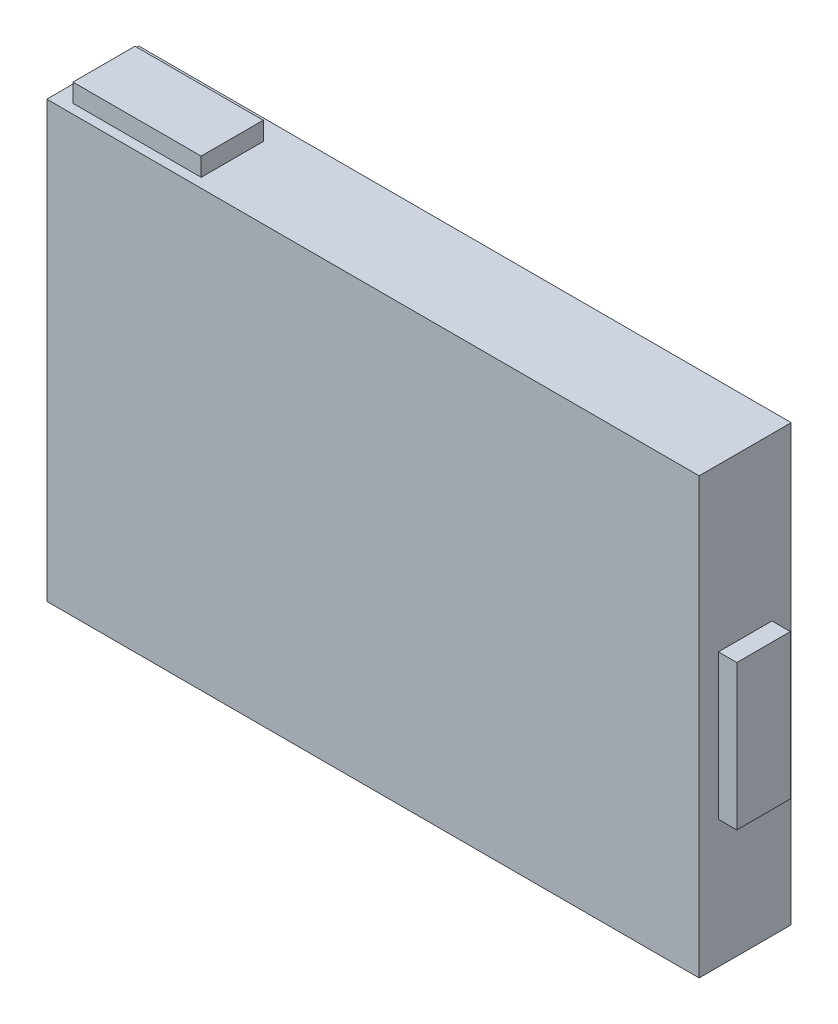
ISO-10303-21;
HEADER;
FILE_DESCRIPTION(('STEP AP214'),'2;1');
FILE_NAME('part.step','',(''),(''),'','','');
FILE_SCHEMA(('AUTOMOTIVE_DESIGN { 1 0 10303 214 1 1 1 1 }'));
ENDSEC;
DATA;
#1=APPLICATION_CONTEXT('core data for automotive mechanical design processes');
#2=APPLICATION_PROTOCOL_DEFINITION('international standard','automotive_design',2000,#1);
#3=PRODUCT_CONTEXT('',#1,'mechanical');
#4=PRODUCT('Part','Part','',(#3));
#5=PRODUCT_RELATED_PRODUCT_CATEGORY('part','',(#4));
#6=PRODUCT_DEFINITION_FORMATION('','',#4);
#7=PRODUCT_DEFINITION_CONTEXT('part definition',#1,'design');
#8=PRODUCT_DEFINITION('design','',#6,#7);
#9=PRODUCT_DEFINITION_SHAPE('','',#8);
#10=(LENGTH_UNIT() NAMED_UNIT(*) SI_UNIT(.MILLI.,.METRE.));
#11=(NAMED_UNIT(*) PLANE_ANGLE_UNIT() SI_UNIT($,.RADIAN.));
#12=(NAMED_UNIT(*) SI_UNIT($,.STERADIAN.) SOLID_ANGLE_UNIT());
#13=UNCERTAINTY_MEASURE_WITH_UNIT(LENGTH_MEASURE(1.E-05),#10,'distance_accuracy_value','');
#14=(GEOMETRIC_REPRESENTATION_CONTEXT(3) GLOBAL_UNCERTAINTY_ASSIGNED_CONTEXT((#13)) GLOBAL_UNIT_ASSIGNED_CONTEXT((#10,
#11,#12)) REPRESENTATION_CONTEXT('',''));
#15=CARTESIAN_POINT('',(0.,0.,0.));
#16=DIRECTION('',(0.,0.,1.));
#17=DIRECTION('',(1.,0.,0.));
#18=AXIS2_PLACEMENT_3D('',#15,#16,#17);
#19=CARTESIAN_POINT('',(95.8711409144546,-20.,20.0911619857132));
#20=DIRECTION('',(0.,0.,-1.));
#21=DIRECTION('',(-1.,0.,0.));
#22=AXIS2_PLACEMENT_3D('',#19,#20,#21);
#23=PLANE('',#22);
#24=DIRECTION('',(0.,-1.,0.));
#25=VECTOR('',#24,1.);
#26=CARTESIAN_POINT('',(90.7911409144546,-20.,20.0911619857132));
#27=LINE('',#26,#25);
#28=CARTESIAN_POINT('',(90.7911409144546,20.,20.0911619857132));
#29=VERTEX_POINT('',#28);
#30=CARTESIAN_POINT('',(90.7911409144546,-20.,20.0911619857132));
#31=VERTEX_POINT('',#30);
#32=EDGE_CURVE('E106',#29,#31,#27,.T.);
#33=ORIENTED_EDGE('',*,*,#32,.T.);
#34=DIRECTION('',(-1.,0.,0.));
#35=VECTOR('',#34,1.);
#36=CARTESIAN_POINT('',(95.8711409144546,-20.,20.0911619857132));
#37=LINE('',#36,#35);
#38=CARTESIAN_POINT('',(95.8711409144546,-20.,20.0911619857132));
#39=VERTEX_POINT('',#38);
#40=EDGE_CURVE('E12',#39,#31,#37,.T.);
#41=ORIENTED_EDGE('',*,*,#40,.F.);
#42=DIRECTION('',(0.,-1.,0.));
#43=VECTOR('',#42,1.);
#44=CARTESIAN_POINT('',(95.8711409144546,-20.,20.0911619857132));
#45=LINE('',#44,#43);
#46=CARTESIAN_POINT('',(95.8711409144546,20.,20.0911619857132));
#47=VERTEX_POINT('',#46);
#48=EDGE_CURVE('E94',#47,#39,#45,.T.);
#49=ORIENTED_EDGE('',*,*,#48,.F.);
#50=DIRECTION('',(-1.,0.,0.));
#51=VECTOR('',#50,1.);
#52=CARTESIAN_POINT('',(95.8711409144546,20.,20.0911619857132));
#53=LINE('',#52,#51);
#54=EDGE_CURVE('E102',#47,#29,#53,.T.);
#55=ORIENTED_EDGE('',*,*,#54,.T.);
#56=EDGE_LOOP('',(#33,#41,#49,#55));
#57=FACE_BOUND('',#56,.T.);
#58=ADVANCED_FACE('F43',(#57),#23,.F.);
#59=CARTESIAN_POINT('',(95.8711409144546,-20.,5.3088380142868));
#60=DIRECTION('',(0.,1.,0.));
#61=DIRECTION('',(0.,0.,1.));
#62=AXIS2_PLACEMENT_3D('',#59,#60,#61);
#63=PLANE('',#62);
#64=DIRECTION('',(0.,0.,-1.));
#65=VECTOR('',#64,1.);
#66=CARTESIAN_POINT('',(90.7911409144546,-20.,5.3088380142868));
#67=LINE('',#66,#65);
#68=CARTESIAN_POINT('',(90.7911409144546,-20.,5.3088380142868));
#69=VERTEX_POINT('',#68);
#70=EDGE_CURVE('E98',#31,#69,#67,.T.);
#71=ORIENTED_EDGE('',*,*,#70,.T.);
#72=DIRECTION('',(-1.,0.,0.));
#73=VECTOR('',#72,1.);
#74=CARTESIAN_POINT('',(95.8711409144546,-20.,5.3088380142868));
#75=LINE('',#74,#73);
#76=CARTESIAN_POINT('',(95.8711409144546,-20.,5.3088380142868));
#77=VERTEX_POINT('',#76);
#78=EDGE_CURVE('E51',#77,#69,#75,.T.);
#79=ORIENTED_EDGE('',*,*,#78,.F.);
#80=DIRECTION('',(0.,0.,-1.));
#81=VECTOR('',#80,1.);
#82=CARTESIAN_POINT('',(95.8711409144546,-20.,5.3088380142868));
#83=LINE('',#82,#81);
#84=EDGE_CURVE('E89',#39,#77,#83,.T.);
#85=ORIENTED_EDGE('',*,*,#84,.F.);
#86=ORIENTED_EDGE('',*,*,#40,.T.);
#87=EDGE_LOOP('',(#71,#79,#85,#86));
#88=FACE_BOUND('',#87,.T.);
#89=ADVANCED_FACE('F97',(#88),#63,.F.);
#90=CARTESIAN_POINT('',(95.8711409144546,-20.,5.3088380142868));
#91=DIRECTION('',(0.,0.,1.));
#92=DIRECTION('',(1.,0.,0.));
#93=AXIS2_PLACEMENT_3D('',#90,#91,#92);
#94=PLANE('',#93);
#95=DIRECTION('',(0.,1.,0.));
#96=VECTOR('',#95,1.);
#97=CARTESIAN_POINT('',(90.7911409144546,-20.,5.3088380142868));
#98=LINE('',#97,#96);
#99=CARTESIAN_POINT('',(90.7911409144546,20.,5.3088380142868));
#100=VERTEX_POINT('',#99);
#101=EDGE_CURVE('E76',#69,#100,#98,.T.);
#102=ORIENTED_EDGE('',*,*,#101,.T.);
#103=DIRECTION('',(-1.,0.,0.));
#104=VECTOR('',#103,1.);
#105=CARTESIAN_POINT('',(95.8711409144546,20.,5.3088380142868));
#106=LINE('',#105,#104);
#107=CARTESIAN_POINT('',(95.8711409144546,20.,5.3088380142868));
#108=VERTEX_POINT('',#107);
#109=EDGE_CURVE('E99',#108,#100,#106,.T.);
#110=ORIENTED_EDGE('',*,*,#109,.F.);
#111=DIRECTION('',(0.,1.,0.));
#112=VECTOR('',#111,1.);
#113=CARTESIAN_POINT('',(95.8711409144546,-20.,5.3088380142868));
#114=LINE('',#113,#112);
#115=EDGE_CURVE('E92',#77,#108,#114,.T.);
#116=ORIENTED_EDGE('',*,*,#115,.F.);
#117=ORIENTED_EDGE('',*,*,#78,.T.);
#118=EDGE_LOOP('',(#102,#110,#116,#117));
#119=FACE_BOUND('',#118,.T.);
#120=ADVANCED_FACE('F100',(#119),#94,.F.);
#121=CARTESIAN_POINT('',(95.8711409144546,20.,5.3088380142868));
#122=DIRECTION('',(0.,-1.,0.));
#123=DIRECTION('',(0.,0.,-1.));
#124=AXIS2_PLACEMENT_3D('',#121,#122,#123);
#125=PLANE('',#124);
#126=DIRECTION('',(0.,0.,1.));
#127=VECTOR('',#126,1.);
#128=CARTESIAN_POINT('',(90.7911409144546,20.,5.3088380142868));
#129=LINE('',#128,#127);
#130=EDGE_CURVE('E82',#100,#29,#129,.T.);
#131=ORIENTED_EDGE('',*,*,#130,.T.);
#132=ORIENTED_EDGE('',*,*,#54,.F.);
#133=DIRECTION('',(0.,0.,1.));
#134=VECTOR('',#133,1.);
#135=CARTESIAN_POINT('',(95.8711409144546,20.,5.3088380142868));
#136=LINE('',#135,#134);
#137=EDGE_CURVE('E59',#108,#47,#136,.T.);
#138=ORIENTED_EDGE('',*,*,#137,.F.);
#139=ORIENTED_EDGE('',*,*,#109,.T.);
#140=EDGE_LOOP('',(#131,#132,#138,#139));
#141=FACE_BOUND('',#140,.T.);
#142=ADVANCED_FACE('F113',(#141),#125,.F.);
#143=CARTESIAN_POINT('',(95.8711409144546,0.,0.));
#144=DIRECTION('',(1.,0.,0.));
#145=DIRECTION('',(0.,0.,-1.));
#146=AXIS2_PLACEMENT_3D('',#143,#144,#145);
#147=PLANE('',#146);
#148=ORIENTED_EDGE('',*,*,#48,.T.);
#149=ORIENTED_EDGE('',*,*,#84,.T.);
#150=ORIENTED_EDGE('',*,*,#115,.T.);
#151=ORIENTED_EDGE('',*,*,#137,.T.);
#152=EDGE_LOOP('',(#148,#149,#150,#151));
#153=FACE_BOUND('',#152,.T.);
#154=ADVANCED_FACE('F90',(#153),#147,.T.);
#155=CARTESIAN_POINT('',(90.7911409144546,0.,0.));
#156=DIRECTION('',(1.,0.,0.));
#157=DIRECTION('',(0.,0.,-1.));
#158=AXIS2_PLACEMENT_3D('',#155,#156,#157);
#159=PLANE('',#158);
#160=ORIENTED_EDGE('',*,*,#32,.F.);
#161=ORIENTED_EDGE('',*,*,#130,.F.);
#162=ORIENTED_EDGE('',*,*,#101,.F.);
#163=ORIENTED_EDGE('',*,*,#70,.F.);
#164=EDGE_LOOP('',(#160,#161,#162,#163));
#165=FACE_BOUND('',#164,.T.);
#166=ADVANCED_FACE('F116',(#165),#159,.F.);
#167=CLOSED_SHELL('',(#58,#89,#120,#142,#154,#166));
#168=MANIFOLD_SOLID_BREP('B2',#167);
#169=CARTESIAN_POINT('',(-84.6027899747349,69.8100094084312,22.786985363933));
#170=DIRECTION('',(1.,0.,0.));
#171=DIRECTION('',(0.,0.,-1.));
#172=AXIS2_PLACEMENT_3D('',#169,#170,#171);
#173=PLANE('',#172);
#174=DIRECTION('',(0.,0.,1.));
#175=VECTOR('',#174,1.);
#176=CARTESIAN_POINT('',(-84.6027899747349,64.7300094084312,22.786985363933));
#177=LINE('',#176,#175);
#178=CARTESIAN_POINT('',(-84.6027899747349,64.7300094084312,5.65292803341598));
#179=VERTEX_POINT('',#178);
#180=CARTESIAN_POINT('',(-84.6027899747349,64.7300094084312,22.786985363933));
#181=VERTEX_POINT('',#180);
#182=EDGE_CURVE('E238',#179,#181,#177,.T.);
#183=ORIENTED_EDGE('',*,*,#182,.T.);
#184=DIRECTION('',(0.,-1.,0.));
#185=VECTOR('',#184,1.);
#186=CARTESIAN_POINT('',(-84.6027899747349,69.8100094084312,22.786985363933));
#187=LINE('',#186,#185);
#188=CARTESIAN_POINT('',(-84.6027899747349,69.8100094084312,22.786985363933));
#189=VERTEX_POINT('',#188);
#190=EDGE_CURVE('E41',#189,#181,#187,.T.);
#191=ORIENTED_EDGE('',*,*,#190,.F.);
#192=DIRECTION('',(0.,0.,1.));
#193=VECTOR('',#192,1.);
#194=CARTESIAN_POINT('',(-84.6027899747349,69.8100094084312,22.786985363933));
#195=LINE('',#194,#193);
#196=CARTESIAN_POINT('',(-84.6027899747349,69.8100094084312,5.65292803341598));
#197=VERTEX_POINT('',#196);
#198=EDGE_CURVE('E226',#197,#189,#195,.T.);
#199=ORIENTED_EDGE('',*,*,#198,.F.);
#200=DIRECTION('',(0.,-1.,0.));
#201=VECTOR('',#200,1.);
#202=CARTESIAN_POINT('',(-84.6027899747349,69.8100094084312,5.65292803341598));
#203=LINE('',#202,#201);
#204=EDGE_CURVE('E234',#197,#179,#203,.T.);
#205=ORIENTED_EDGE('',*,*,#204,.T.);
#206=EDGE_LOOP('',(#183,#191,#199,#205));
#207=FACE_BOUND('',#206,.T.);
#208=ADVANCED_FACE('F175',(#207),#173,.F.);
#209=CARTESIAN_POINT('',(-49.2292522601191,69.8100094084312,22.786985363933));
#210=DIRECTION('',(0.,0.,-1.));
#211=DIRECTION('',(-1.,0.,0.));
#212=AXIS2_PLACEMENT_3D('',#209,#210,#211);
#213=PLANE('',#212);
#214=DIRECTION('',(1.,0.,0.));
#215=VECTOR('',#214,1.);
#216=CARTESIAN_POINT('',(-49.2292522601191,64.7300094084312,22.786985363933));
#217=LINE('',#216,#215);
#218=CARTESIAN_POINT('',(-49.2292522601191,64.7300094084312,22.786985363933));
#219=VERTEX_POINT('',#218);
#220=EDGE_CURVE('E230',#181,#219,#217,.T.);
#221=ORIENTED_EDGE('',*,*,#220,.T.);
#222=DIRECTION('',(0.,-1.,0.));
#223=VECTOR('',#222,1.);
#224=CARTESIAN_POINT('',(-49.2292522601191,69.8100094084312,22.786985363933));
#225=LINE('',#224,#223);
#226=CARTESIAN_POINT('',(-49.2292522601191,69.8100094084312,22.786985363933));
#227=VERTEX_POINT('',#226);
#228=EDGE_CURVE('E183',#227,#219,#225,.T.);
#229=ORIENTED_EDGE('',*,*,#228,.F.);
#230=DIRECTION('',(1.,0.,0.));
#231=VECTOR('',#230,1.);
#232=CARTESIAN_POINT('',(-49.2292522601191,69.8100094084312,22.786985363933));
#233=LINE('',#232,#231);
#234=EDGE_CURVE('E221',#189,#227,#233,.T.);
#235=ORIENTED_EDGE('',*,*,#234,.F.);
#236=ORIENTED_EDGE('',*,*,#190,.T.);
#237=EDGE_LOOP('',(#221,#229,#235,#236));
#238=FACE_BOUND('',#237,.T.);
#239=ADVANCED_FACE('F229',(#238),#213,.F.);
#240=CARTESIAN_POINT('',(-49.2292522601191,69.8100094084312,22.786985363933));
#241=DIRECTION('',(-1.,0.,0.));
#242=DIRECTION('',(0.,0.,1.));
#243=AXIS2_PLACEMENT_3D('',#240,#241,#242);
#244=PLANE('',#243);
#245=DIRECTION('',(0.,0.,-1.));
#246=VECTOR('',#245,1.);
#247=CARTESIAN_POINT('',(-49.2292522601191,64.7300094084312,22.786985363933));
#248=LINE('',#247,#246);
#249=CARTESIAN_POINT('',(-49.2292522601191,64.7300094084312,5.65292803341598));
#250=VERTEX_POINT('',#249);
#251=EDGE_CURVE('E208',#219,#250,#248,.T.);
#252=ORIENTED_EDGE('',*,*,#251,.T.);
#253=DIRECTION('',(0.,-1.,0.));
#254=VECTOR('',#253,1.);
#255=CARTESIAN_POINT('',(-49.2292522601191,69.8100094084312,5.65292803341598));
#256=LINE('',#255,#254);
#257=CARTESIAN_POINT('',(-49.2292522601191,69.8100094084312,5.65292803341598));
#258=VERTEX_POINT('',#257);
#259=EDGE_CURVE('E231',#258,#250,#256,.T.);
#260=ORIENTED_EDGE('',*,*,#259,.F.);
#261=DIRECTION('',(0.,0.,-1.));
#262=VECTOR('',#261,1.);
#263=CARTESIAN_POINT('',(-49.2292522601191,69.8100094084312,22.786985363933));
#264=LINE('',#263,#262);
#265=EDGE_CURVE('E224',#227,#258,#264,.T.);
#266=ORIENTED_EDGE('',*,*,#265,.F.);
#267=ORIENTED_EDGE('',*,*,#228,.T.);
#268=EDGE_LOOP('',(#252,#260,#266,#267));
#269=FACE_BOUND('',#268,.T.);
#270=ADVANCED_FACE('F232',(#269),#244,.F.);
#271=CARTESIAN_POINT('',(-49.2292522601191,69.8100094084312,5.65292803341598));
#272=DIRECTION('',(0.,0.,1.));
#273=DIRECTION('',(1.,0.,0.));
#274=AXIS2_PLACEMENT_3D('',#271,#272,#273);
#275=PLANE('',#274);
#276=DIRECTION('',(-1.,0.,0.));
#277=VECTOR('',#276,1.);
#278=CARTESIAN_POINT('',(-49.2292522601191,64.7300094084312,5.65292803341598));
#279=LINE('',#278,#277);
#280=EDGE_CURVE('E214',#250,#179,#279,.T.);
#281=ORIENTED_EDGE('',*,*,#280,.T.);
#282=ORIENTED_EDGE('',*,*,#204,.F.);
#283=DIRECTION('',(-1.,0.,0.));
#284=VECTOR('',#283,1.);
#285=CARTESIAN_POINT('',(-49.2292522601191,69.8100094084312,5.65292803341598));
#286=LINE('',#285,#284);
#287=EDGE_CURVE('E191',#258,#197,#286,.T.);
#288=ORIENTED_EDGE('',*,*,#287,.F.);
#289=ORIENTED_EDGE('',*,*,#259,.T.);
#290=EDGE_LOOP('',(#281,#282,#288,#289));
#291=FACE_BOUND('',#290,.T.);
#292=ADVANCED_FACE('F245',(#291),#275,.F.);
#293=CARTESIAN_POINT('',(0.,69.8100094084312,0.));
#294=DIRECTION('',(0.,1.,0.));
#295=DIRECTION('',(0.,0.,1.));
#296=AXIS2_PLACEMENT_3D('',#293,#294,#295);
#297=PLANE('',#296);
#298=ORIENTED_EDGE('',*,*,#198,.T.);
#299=ORIENTED_EDGE('',*,*,#234,.T.);
#300=ORIENTED_EDGE('',*,*,#265,.T.);
#301=ORIENTED_EDGE('',*,*,#287,.T.);
#302=EDGE_LOOP('',(#298,#299,#300,#301));
#303=FACE_BOUND('',#302,.T.);
#304=ADVANCED_FACE('F222',(#303),#297,.T.);
#305=CARTESIAN_POINT('',(0.,64.7300094084312,0.));
#306=DIRECTION('',(0.,1.,0.));
#307=DIRECTION('',(0.,0.,1.));
#308=AXIS2_PLACEMENT_3D('',#305,#306,#307);
#309=PLANE('',#308);
#310=ORIENTED_EDGE('',*,*,#182,.F.);
#311=ORIENTED_EDGE('',*,*,#280,.F.);
#312=ORIENTED_EDGE('',*,*,#251,.F.);
#313=ORIENTED_EDGE('',*,*,#220,.F.);
#314=EDGE_LOOP('',(#310,#311,#312,#313));
#315=FACE_BOUND('',#314,.T.);
#316=ADVANCED_FACE('F248',(#315),#309,.F.);
#317=CLOSED_SHELL('',(#208,#239,#270,#292,#304,#316));
#318=MANIFOLD_SOLID_BREP('B6',#317);
#319=CARTESIAN_POINT('',(-89.2088590855451,64.7300094084312,25.4));
#320=DIRECTION('',(1.,0.,0.));
#321=DIRECTION('',(0.,0.,-1.));
#322=AXIS2_PLACEMENT_3D('',#319,#320,#321);
#323=PLANE('',#322);
#324=DIRECTION('',(0.,-1.,0.));
#325=VECTOR('',#324,1.);
#326=CARTESIAN_POINT('',(-89.2088590855451,64.7300094084312,0.));
#327=LINE('',#326,#325);
#328=CARTESIAN_POINT('',(-89.2088590855451,64.7300094084312,0.));
#329=VERTEX_POINT('',#328);
#330=CARTESIAN_POINT('',(-89.2088590855451,-55.2699905915688,0.));
#331=VERTEX_POINT('',#330);
#332=EDGE_CURVE('E504',#329,#331,#327,.T.);
#333=ORIENTED_EDGE('',*,*,#332,.T.);
#334=DIRECTION('',(0.,0.,-1.));
#335=VECTOR('',#334,1.);
#336=CARTESIAN_POINT('',(-89.2088590855451,-55.2699905915688,25.4));
#337=LINE('',#336,#335);
#338=CARTESIAN_POINT('',(-89.2088590855451,-55.2699905915688,25.4));
#339=VERTEX_POINT('',#338);
#340=EDGE_CURVE('E173',#339,#331,#337,.T.);
#341=ORIENTED_EDGE('',*,*,#340,.F.);
#342=DIRECTION('',(0.,-1.,0.));
#343=VECTOR('',#342,1.);
#344=CARTESIAN_POINT('',(-89.2088590855451,64.7300094084312,25.4));
#345=LINE('',#344,#343);
#346=CARTESIAN_POINT('',(-89.2088590855451,64.7300094084312,25.4));
#347=VERTEX_POINT('',#346);
#348=EDGE_CURVE('E511',#347,#339,#345,.T.);
#349=ORIENTED_EDGE('',*,*,#348,.F.);
#350=DIRECTION('',(0.,0.,-1.));
#351=VECTOR('',#350,1.);
#352=CARTESIAN_POINT('',(-89.2088590855451,64.7300094084312,25.4));
#353=LINE('',#352,#351);
#354=EDGE_CURVE('E521',#347,#329,#353,.T.);
#355=ORIENTED_EDGE('',*,*,#354,.T.);
#356=EDGE_LOOP('',(#333,#341,#349,#355));
#357=FACE_BOUND('',#356,.T.);
#358=ADVANCED_FACE('F298',(#357),#323,.F.);
#359=CARTESIAN_POINT('',(-89.2088590855451,-55.2699905915688,25.4));
#360=DIRECTION('',(0.,1.,0.));
#361=DIRECTION('',(0.,0.,1.));
#362=AXIS2_PLACEMENT_3D('',#359,#360,#361);
#363=PLANE('',#362);
#364=DIRECTION('',(1.,0.,0.));
#365=VECTOR('',#364,1.);
#366=CARTESIAN_POINT('',(82.5,-55.2699905915688,5.37657227002138));
#367=LINE('',#366,#365);
#368=CARTESIAN_POINT('',(-82.5,-55.2699905915688,5.37657227002136));
#369=VERTEX_POINT('',#368);
#370=CARTESIAN_POINT('',(82.5,-55.2699905915688,5.37657227002138));
#371=VERTEX_POINT('',#370);
#372=EDGE_CURVE('E494',#369,#371,#367,.T.);
#373=ORIENTED_EDGE('',*,*,#372,.F.);
#374=DIRECTION('',(0.,0.,-1.));
#375=VECTOR('',#374,1.);
#376=CARTESIAN_POINT('',(-82.5,-55.2699905915688,5.37657227002136));
#377=LINE('',#376,#375);
#378=CARTESIAN_POINT('',(-82.5,-55.2699905915688,20.8524950201658));
#379=VERTEX_POINT('',#378);
#380=EDGE_CURVE('E473',#379,#369,#377,.T.);
#381=ORIENTED_EDGE('',*,*,#380,.F.);
#382=DIRECTION('',(-1.,0.,0.));
#383=VECTOR('',#382,1.);
#384=CARTESIAN_POINT('',(82.5,-55.2699905915688,20.8524950201658));
#385=LINE('',#384,#383);
#386=CARTESIAN_POINT('',(82.5,-55.2699905915688,20.8524950201658));
#387=VERTEX_POINT('',#386);
#388=EDGE_CURVE('E483',#387,#379,#385,.T.);
#389=ORIENTED_EDGE('',*,*,#388,.F.);
#390=DIRECTION('',(0.,0.,1.));
#391=VECTOR('',#390,1.);
#392=CARTESIAN_POINT('',(82.5,-55.2699905915688,5.37657227002138));
#393=LINE('',#392,#391);
#394=EDGE_CURVE('E497',#371,#387,#393,.T.);
#395=ORIENTED_EDGE('',*,*,#394,.F.);
#396=EDGE_LOOP('',(#373,#381,#389,#395));
#397=FACE_BOUND('',#396,.T.);
#398=DIRECTION('',(1.,0.,0.));
#399=VECTOR('',#398,1.);
#400=CARTESIAN_POINT('',(-89.2088590855451,-55.2699905915688,0.));
#401=LINE('',#400,#399);
#402=CARTESIAN_POINT('',(90.7911409144546,-55.2699905915688,0.));
#403=VERTEX_POINT('',#402);
#404=EDGE_CURVE('E524',#331,#403,#401,.T.);
#405=ORIENTED_EDGE('',*,*,#404,.T.);
#406=DIRECTION('',(0.,0.,-1.));
#407=VECTOR('',#406,1.);
#408=CARTESIAN_POINT('',(90.7911409144546,-55.2699905915688,25.4));
#409=LINE('',#408,#407);
#410=CARTESIAN_POINT('',(90.7911409144546,-55.2699905915688,25.4));
#411=VERTEX_POINT('',#410);
#412=EDGE_CURVE('E305',#411,#403,#409,.T.);
#413=ORIENTED_EDGE('',*,*,#412,.F.);
#414=DIRECTION('',(1.,0.,0.));
#415=VECTOR('',#414,1.);
#416=CARTESIAN_POINT('',(-89.2088590855451,-55.2699905915688,25.4));
#417=LINE('',#416,#415);
#418=EDGE_CURVE('E514',#339,#411,#417,.T.);
#419=ORIENTED_EDGE('',*,*,#418,.F.);
#420=ORIENTED_EDGE('',*,*,#340,.T.);
#421=EDGE_LOOP('',(#405,#413,#419,#420));
#422=FACE_BOUND('',#421,.T.);
#423=ADVANCED_FACE('F554',(#397,#422),#363,.F.);
#424=CARTESIAN_POINT('',(90.7911409144546,64.7300094084312,25.4));
#425=DIRECTION('',(-1.,0.,0.));
#426=DIRECTION('',(0.,0.,1.));
#427=AXIS2_PLACEMENT_3D('',#424,#425,#426);
#428=PLANE('',#427);
#429=DIRECTION('',(0.,0.,-1.));
#430=VECTOR('',#429,1.);
#431=CARTESIAN_POINT('',(90.7911409144546,-20.,5.3088380142868));
#432=LINE('',#431,#430);
#433=CARTESIAN_POINT('',(90.7911409144546,-20.,20.0911619857132));
#434=VERTEX_POINT('',#433);
#435=CARTESIAN_POINT('',(90.7911409144546,-20.,5.3088380142868));
#436=VERTEX_POINT('',#435);
#437=EDGE_CURVE('E439',#434,#436,#432,.T.);
#438=ORIENTED_EDGE('',*,*,#437,.F.);
#439=DIRECTION('',(0.,-1.,0.));
#440=VECTOR('',#439,1.);
#441=CARTESIAN_POINT('',(90.7911409144546,-20.,20.0911619857132));
#442=LINE('',#441,#440);
#443=CARTESIAN_POINT('',(90.7911409144546,20.,20.0911619857132));
#444=VERTEX_POINT('',#443);
#445=EDGE_CURVE('E312',#444,#434,#442,.T.);
#446=ORIENTED_EDGE('',*,*,#445,.F.);
#447=DIRECTION('',(0.,0.,1.));
#448=VECTOR('',#447,1.);
#449=CARTESIAN_POINT('',(90.7911409144546,20.,5.3088380142868));
#450=LINE('',#449,#448);
#451=CARTESIAN_POINT('',(90.7911409144546,20.,5.3088380142868));
#452=VERTEX_POINT('',#451);
#453=EDGE_CURVE('E430',#452,#444,#450,.T.);
#454=ORIENTED_EDGE('',*,*,#453,.F.);
#455=DIRECTION('',(0.,1.,0.));
#456=VECTOR('',#455,1.);
#457=CARTESIAN_POINT('',(90.7911409144546,-20.,5.3088380142868));
#458=LINE('',#457,#456);
#459=EDGE_CURVE('E433',#436,#452,#458,.T.);
#460=ORIENTED_EDGE('',*,*,#459,.F.);
#461=EDGE_LOOP('',(#438,#446,#454,#460));
#462=FACE_BOUND('',#461,.T.);
#463=DIRECTION('',(0.,1.,0.));
#464=VECTOR('',#463,1.);
#465=CARTESIAN_POINT('',(90.7911409144546,64.7300094084312,0.));
#466=LINE('',#465,#464);
#467=CARTESIAN_POINT('',(90.7911409144546,64.7300094084312,0.));
#468=VERTEX_POINT('',#467);
#469=EDGE_CURVE('E526',#403,#468,#466,.T.);
#470=ORIENTED_EDGE('',*,*,#469,.T.);
#471=DIRECTION('',(0.,0.,-1.));
#472=VECTOR('',#471,1.);
#473=CARTESIAN_POINT('',(90.7911409144546,64.7300094084312,25.4));
#474=LINE('',#473,#472);
#475=CARTESIAN_POINT('',(90.7911409144546,64.7300094084312,25.4));
#476=VERTEX_POINT('',#475);
#477=EDGE_CURVE('E531',#476,#468,#474,.T.);
#478=ORIENTED_EDGE('',*,*,#477,.F.);
#479=DIRECTION('',(0.,1.,0.));
#480=VECTOR('',#479,1.);
#481=CARTESIAN_POINT('',(90.7911409144546,64.7300094084312,25.4));
#482=LINE('',#481,#480);
#483=EDGE_CURVE('E517',#411,#476,#482,.T.);
#484=ORIENTED_EDGE('',*,*,#483,.F.);
#485=ORIENTED_EDGE('',*,*,#412,.T.);
#486=EDGE_LOOP('',(#470,#478,#484,#485));
#487=FACE_BOUND('',#486,.T.);
#488=ADVANCED_FACE('F538',(#462,#487),#428,.F.);
#489=CARTESIAN_POINT('',(-89.2088590855451,64.7300094084312,25.4));
#490=DIRECTION('',(0.,-1.,0.));
#491=DIRECTION('',(0.,0.,-1.));
#492=AXIS2_PLACEMENT_3D('',#489,#490,#491);
#493=PLANE('',#492);
#494=DIRECTION('',(1.,0.,0.));
#495=VECTOR('',#494,1.);
#496=CARTESIAN_POINT('',(-49.2292522601191,64.7300094084312,22.786985363933));
#497=LINE('',#496,#495);
#498=CARTESIAN_POINT('',(-84.6027899747349,64.7300094084312,22.786985363933));
#499=VERTEX_POINT('',#498);
#500=CARTESIAN_POINT('',(-49.2292522601191,64.7300094084312,22.786985363933));
#501=VERTEX_POINT('',#500);
#502=EDGE_CURVE('E463',#499,#501,#497,.T.);
#503=ORIENTED_EDGE('',*,*,#502,.F.);
#504=DIRECTION('',(0.,0.,1.));
#505=VECTOR('',#504,1.);
#506=CARTESIAN_POINT('',(-84.6027899747349,64.7300094084312,22.786985363933));
#507=LINE('',#506,#505);
#508=CARTESIAN_POINT('',(-84.6027899747349,64.7300094084312,5.65292803341598));
#509=VERTEX_POINT('',#508);
#510=EDGE_CURVE('E320',#509,#499,#507,.T.);
#511=ORIENTED_EDGE('',*,*,#510,.F.);
#512=DIRECTION('',(-1.,0.,0.));
#513=VECTOR('',#512,1.);
#514=CARTESIAN_POINT('',(-49.2292522601191,64.7300094084312,5.65292803341598));
#515=LINE('',#514,#513);
#516=CARTESIAN_POINT('',(-49.2292522601191,64.7300094084312,5.65292803341598));
#517=VERTEX_POINT('',#516);
#518=EDGE_CURVE('E452',#517,#509,#515,.T.);
#519=ORIENTED_EDGE('',*,*,#518,.F.);
#520=DIRECTION('',(0.,0.,-1.));
#521=VECTOR('',#520,1.);
#522=CARTESIAN_POINT('',(-49.2292522601191,64.7300094084312,22.786985363933));
#523=LINE('',#522,#521);
#524=EDGE_CURVE('E466',#501,#517,#523,.T.);
#525=ORIENTED_EDGE('',*,*,#524,.F.);
#526=EDGE_LOOP('',(#503,#511,#519,#525));
#527=FACE_BOUND('',#526,.T.);
#528=DIRECTION('',(-1.,0.,0.));
#529=VECTOR('',#528,1.);
#530=CARTESIAN_POINT('',(-89.2088590855451,64.7300094084312,0.));
#531=LINE('',#530,#529);
#532=EDGE_CURVE('E515',#468,#329,#531,.T.);
#533=ORIENTED_EDGE('',*,*,#532,.T.);
#534=ORIENTED_EDGE('',*,*,#354,.F.);
#535=DIRECTION('',(-1.,0.,0.));
#536=VECTOR('',#535,1.);
#537=CARTESIAN_POINT('',(-89.2088590855451,64.7300094084312,25.4));
#538=LINE('',#537,#536);
#539=EDGE_CURVE('E519',#476,#347,#538,.T.);
#540=ORIENTED_EDGE('',*,*,#539,.F.);
#541=ORIENTED_EDGE('',*,*,#477,.T.);
#542=EDGE_LOOP('',(#533,#534,#540,#541));
#543=FACE_BOUND('',#542,.T.);
#544=ADVANCED_FACE('F547',(#527,#543),#493,.F.);
#545=CARTESIAN_POINT('',(0.,0.,25.4));
#546=DIRECTION('',(0.,0.,1.));
#547=DIRECTION('',(1.,0.,0.));
#548=AXIS2_PLACEMENT_3D('',#545,#546,#547);
#549=PLANE('',#548);
#550=ORIENTED_EDGE('',*,*,#348,.T.);
#551=ORIENTED_EDGE('',*,*,#418,.T.);
#552=ORIENTED_EDGE('',*,*,#483,.T.);
#553=ORIENTED_EDGE('',*,*,#539,.T.);
#554=EDGE_LOOP('',(#550,#551,#552,#553));
#555=FACE_BOUND('',#554,.T.);
#556=ADVANCED_FACE('F553',(#555),#549,.T.);
#557=CARTESIAN_POINT('',(0.,0.,0.));
#558=DIRECTION('',(0.,0.,1.));
#559=DIRECTION('',(1.,0.,0.));
#560=AXIS2_PLACEMENT_3D('',#557,#558,#559);
#561=PLANE('',#560);
#562=ORIENTED_EDGE('',*,*,#332,.F.);
#563=ORIENTED_EDGE('',*,*,#532,.F.);
#564=ORIENTED_EDGE('',*,*,#469,.F.);
#565=ORIENTED_EDGE('',*,*,#404,.F.);
#566=EDGE_LOOP('',(#562,#563,#564,#565));
#567=FACE_BOUND('',#566,.T.);
#568=ADVANCED_FACE('F544',(#567),#561,.F.);
#569=CARTESIAN_POINT('',(-82.5,-29.8699905915688,5.37657227002136));
#570=DIRECTION('',(-1.,0.,0.));
#571=DIRECTION('',(0.,0.,1.));
#572=AXIS2_PLACEMENT_3D('',#569,#570,#571);
#573=PLANE('',#572);
#574=ORIENTED_EDGE('',*,*,#380,.T.);
#575=DIRECTION('',(0.,-1.,0.));
#576=VECTOR('',#575,1.);
#577=CARTESIAN_POINT('',(-82.5,-29.8699905915688,5.37657227002136));
#578=LINE('',#577,#576);
#579=CARTESIAN_POINT('',(-82.5,-29.8699905915688,5.37657227002136));
#580=VERTEX_POINT('',#579);
#581=EDGE_CURVE('E492',#580,#369,#578,.T.);
#582=ORIENTED_EDGE('',*,*,#581,.F.);
#583=DIRECTION('',(0.,0.,-1.));
#584=VECTOR('',#583,1.);
#585=CARTESIAN_POINT('',(-82.5,-29.8699905915688,5.37657227002136));
#586=LINE('',#585,#584);
#587=CARTESIAN_POINT('',(-82.5,-29.8699905915688,20.8524950201658));
#588=VERTEX_POINT('',#587);
#589=EDGE_CURVE('E479',#588,#580,#586,.T.);
#590=ORIENTED_EDGE('',*,*,#589,.F.);
#591=DIRECTION('',(0.,-1.,0.));
#592=VECTOR('',#591,1.);
#593=CARTESIAN_POINT('',(-82.5,-29.8699905915688,20.8524950201658));
#594=LINE('',#593,#592);
#595=EDGE_CURVE('E502',#588,#379,#594,.T.);
#596=ORIENTED_EDGE('',*,*,#595,.T.);
#597=EDGE_LOOP('',(#574,#582,#590,#596));
#598=FACE_BOUND('',#597,.T.);
#599=ADVANCED_FACE('F570',(#598),#573,.F.);
#600=CARTESIAN_POINT('',(82.5,-29.8699905915688,20.8524950201658));
#601=DIRECTION('',(0.,0.,1.));
#602=DIRECTION('',(1.,0.,0.));
#603=AXIS2_PLACEMENT_3D('',#600,#601,#602);
#604=PLANE('',#603);
#605=ORIENTED_EDGE('',*,*,#388,.T.);
#606=ORIENTED_EDGE('',*,*,#595,.F.);
#607=DIRECTION('',(-1.,0.,0.));
#608=VECTOR('',#607,1.);
#609=CARTESIAN_POINT('',(82.5,-29.8699905915688,20.8524950201658));
#610=LINE('',#609,#608);
#611=CARTESIAN_POINT('',(82.5,-29.8699905915688,20.8524950201658));
#612=VERTEX_POINT('',#611);
#613=EDGE_CURVE('E489',#612,#588,#610,.T.);
#614=ORIENTED_EDGE('',*,*,#613,.F.);
#615=DIRECTION('',(0.,-1.,0.));
#616=VECTOR('',#615,1.);
#617=CARTESIAN_POINT('',(82.5,-29.8699905915688,20.8524950201658));
#618=LINE('',#617,#616);
#619=EDGE_CURVE('E505',#612,#387,#618,.T.);
#620=ORIENTED_EDGE('',*,*,#619,.T.);
#621=EDGE_LOOP('',(#605,#606,#614,#620));
#622=FACE_BOUND('',#621,.T.);
#623=ADVANCED_FACE('F575',(#622),#604,.F.);
#624=CARTESIAN_POINT('',(82.5,-29.8699905915688,5.37657227002138));
#625=DIRECTION('',(1.,0.,0.));
#626=DIRECTION('',(0.,0.,-1.));
#627=AXIS2_PLACEMENT_3D('',#624,#625,#626);
#628=PLANE('',#627);
#629=ORIENTED_EDGE('',*,*,#394,.T.);
#630=ORIENTED_EDGE('',*,*,#619,.F.);
#631=DIRECTION('',(0.,0.,1.));
#632=VECTOR('',#631,1.);
#633=CARTESIAN_POINT('',(82.5,-29.8699905915688,5.37657227002138));
#634=LINE('',#633,#632);
#635=CARTESIAN_POINT('',(82.5,-29.8699905915688,5.37657227002138));
#636=VERTEX_POINT('',#635);
#637=EDGE_CURVE('E486',#636,#612,#634,.T.);
#638=ORIENTED_EDGE('',*,*,#637,.F.);
#639=DIRECTION('',(0.,-1.,0.));
#640=VECTOR('',#639,1.);
#641=CARTESIAN_POINT('',(82.5,-29.8699905915688,5.37657227002138));
#642=LINE('',#641,#640);
#643=EDGE_CURVE('E507',#636,#371,#642,.T.);
#644=ORIENTED_EDGE('',*,*,#643,.T.);
#645=EDGE_LOOP('',(#629,#630,#638,#644));
#646=FACE_BOUND('',#645,.T.);
#647=ADVANCED_FACE('F581',(#646),#628,.F.);
#648=CARTESIAN_POINT('',(82.5,-29.8699905915688,5.37657227002138));
#649=DIRECTION('',(0.,0.,-1.));
#650=DIRECTION('',(-1.,0.,0.));
#651=AXIS2_PLACEMENT_3D('',#648,#649,#650);
#652=PLANE('',#651);
#653=ORIENTED_EDGE('',*,*,#372,.T.);
#654=ORIENTED_EDGE('',*,*,#643,.F.);
#655=DIRECTION('',(1.,0.,0.));
#656=VECTOR('',#655,1.);
#657=CARTESIAN_POINT('',(82.5,-29.8699905915688,5.37657227002138));
#658=LINE('',#657,#656);
#659=EDGE_CURVE('E482',#580,#636,#658,.T.);
#660=ORIENTED_EDGE('',*,*,#659,.F.);
#661=ORIENTED_EDGE('',*,*,#581,.T.);
#662=EDGE_LOOP('',(#653,#654,#660,#661));
#663=FACE_BOUND('',#662,.T.);
#664=ADVANCED_FACE('F577',(#663),#652,.F.);
#665=CARTESIAN_POINT('',(0.,-29.8699905915688,0.));
#666=DIRECTION('',(0.,-1.,0.));
#667=DIRECTION('',(0.,0.,-1.));
#668=AXIS2_PLACEMENT_3D('',#665,#666,#667);
#669=PLANE('',#668);
#670=ORIENTED_EDGE('',*,*,#589,.T.);
#671=ORIENTED_EDGE('',*,*,#659,.T.);
#672=ORIENTED_EDGE('',*,*,#637,.T.);
#673=ORIENTED_EDGE('',*,*,#613,.T.);
#674=EDGE_LOOP('',(#670,#671,#672,#673));
#675=FACE_BOUND('',#674,.T.);
#676=ADVANCED_FACE('F580',(#675),#669,.T.);
#677=CARTESIAN_POINT('',(-84.6027899747349,39.3300094084312,22.786985363933));
#678=DIRECTION('',(-1.,0.,0.));
#679=DIRECTION('',(0.,0.,1.));
#680=AXIS2_PLACEMENT_3D('',#677,#678,#679);
#681=PLANE('',#680);
#682=ORIENTED_EDGE('',*,*,#510,.T.);
#683=DIRECTION('',(0.,1.,0.));
#684=VECTOR('',#683,1.);
#685=CARTESIAN_POINT('',(-84.6027899747349,39.3300094084312,22.786985363933));
#686=LINE('',#685,#684);
#687=CARTESIAN_POINT('',(-84.6027899747349,39.3300094084312,22.786985363933));
#688=VERTEX_POINT('',#687);
#689=EDGE_CURVE('E461',#688,#499,#686,.T.);
#690=ORIENTED_EDGE('',*,*,#689,.F.);
#691=DIRECTION('',(0.,0.,1.));
#692=VECTOR('',#691,1.);
#693=CARTESIAN_POINT('',(-84.6027899747349,39.3300094084312,22.786985363933));
#694=LINE('',#693,#692);
#695=CARTESIAN_POINT('',(-84.6027899747349,39.3300094084312,5.65292803341598));
#696=VERTEX_POINT('',#695);
#697=EDGE_CURVE('E448',#696,#688,#694,.T.);
#698=ORIENTED_EDGE('',*,*,#697,.F.);
#699=DIRECTION('',(0.,1.,0.));
#700=VECTOR('',#699,1.);
#701=CARTESIAN_POINT('',(-84.6027899747349,39.3300094084312,5.65292803341598));
#702=LINE('',#701,#700);
#703=EDGE_CURVE('E471',#696,#509,#702,.T.);
#704=ORIENTED_EDGE('',*,*,#703,.T.);
#705=EDGE_LOOP('',(#682,#690,#698,#704));
#706=FACE_BOUND('',#705,.T.);
#707=ADVANCED_FACE('F591',(#706),#681,.F.);
#708=CARTESIAN_POINT('',(-49.2292522601191,39.3300094084312,5.65292803341598));
#709=DIRECTION('',(0.,0.,-1.));
#710=DIRECTION('',(-1.,0.,0.));
#711=AXIS2_PLACEMENT_3D('',#708,#709,#710);
#712=PLANE('',#711);
#713=ORIENTED_EDGE('',*,*,#518,.T.);
#714=ORIENTED_EDGE('',*,*,#703,.F.);
#715=DIRECTION('',(-1.,0.,0.));
#716=VECTOR('',#715,1.);
#717=CARTESIAN_POINT('',(-49.2292522601191,39.3300094084312,5.65292803341598));
#718=LINE('',#717,#716);
#719=CARTESIAN_POINT('',(-49.2292522601191,39.3300094084312,5.65292803341598));
#720=VERTEX_POINT('',#719);
#721=EDGE_CURVE('E458',#720,#696,#718,.T.);
#722=ORIENTED_EDGE('',*,*,#721,.F.);
#723=DIRECTION('',(0.,1.,0.));
#724=VECTOR('',#723,1.);
#725=CARTESIAN_POINT('',(-49.2292522601191,39.3300094084312,5.65292803341598));
#726=LINE('',#725,#724);
#727=EDGE_CURVE('E474',#720,#517,#726,.T.);
#728=ORIENTED_EDGE('',*,*,#727,.T.);
#729=EDGE_LOOP('',(#713,#714,#722,#728));
#730=FACE_BOUND('',#729,.T.);
#731=ADVANCED_FACE('F595',(#730),#712,.F.);
#732=CARTESIAN_POINT('',(-49.2292522601191,39.3300094084312,22.786985363933));
#733=DIRECTION('',(1.,0.,0.));
#734=DIRECTION('',(0.,0.,-1.));
#735=AXIS2_PLACEMENT_3D('',#732,#733,#734);
#736=PLANE('',#735);
#737=ORIENTED_EDGE('',*,*,#524,.T.);
#738=ORIENTED_EDGE('',*,*,#727,.F.);
#739=DIRECTION('',(0.,0.,-1.));
#740=VECTOR('',#739,1.);
#741=CARTESIAN_POINT('',(-49.2292522601191,39.3300094084312,22.786985363933));
#742=LINE('',#741,#740);
#743=CARTESIAN_POINT('',(-49.2292522601191,39.3300094084312,22.786985363933));
#744=VERTEX_POINT('',#743);
#745=EDGE_CURVE('E455',#744,#720,#742,.T.);
#746=ORIENTED_EDGE('',*,*,#745,.F.);
#747=DIRECTION('',(0.,1.,0.));
#748=VECTOR('',#747,1.);
#749=CARTESIAN_POINT('',(-49.2292522601191,39.3300094084312,22.786985363933));
#750=LINE('',#749,#748);
#751=EDGE_CURVE('E476',#744,#501,#750,.T.);
#752=ORIENTED_EDGE('',*,*,#751,.T.);
#753=EDGE_LOOP('',(#737,#738,#746,#752));
#754=FACE_BOUND('',#753,.T.);
#755=ADVANCED_FACE('F600',(#754),#736,.F.);
#756=CARTESIAN_POINT('',(-49.2292522601191,39.3300094084312,22.786985363933));
#757=DIRECTION('',(0.,0.,1.));
#758=DIRECTION('',(1.,0.,0.));
#759=AXIS2_PLACEMENT_3D('',#756,#757,#758);
#760=PLANE('',#759);
#761=ORIENTED_EDGE('',*,*,#502,.T.);
#762=ORIENTED_EDGE('',*,*,#751,.F.);
#763=DIRECTION('',(1.,0.,0.));
#764=VECTOR('',#763,1.);
#765=CARTESIAN_POINT('',(-49.2292522601191,39.3300094084312,22.786985363933));
#766=LINE('',#765,#764);
#767=EDGE_CURVE('E451',#688,#744,#766,.T.);
#768=ORIENTED_EDGE('',*,*,#767,.F.);
#769=ORIENTED_EDGE('',*,*,#689,.T.);
#770=EDGE_LOOP('',(#761,#762,#768,#769));
#771=FACE_BOUND('',#770,.T.);
#772=ADVANCED_FACE('F596',(#771),#760,.F.);
#773=CARTESIAN_POINT('',(0.,39.3300094084312,0.));
#774=DIRECTION('',(0.,1.,0.));
#775=DIRECTION('',(0.,0.,1.));
#776=AXIS2_PLACEMENT_3D('',#773,#774,#775);
#777=PLANE('',#776);
#778=ORIENTED_EDGE('',*,*,#697,.T.);
#779=ORIENTED_EDGE('',*,*,#767,.T.);
#780=ORIENTED_EDGE('',*,*,#745,.T.);
#781=ORIENTED_EDGE('',*,*,#721,.T.);
#782=EDGE_LOOP('',(#778,#779,#780,#781));
#783=FACE_BOUND('',#782,.T.);
#784=ADVANCED_FACE('F599',(#783),#777,.T.);
#785=CARTESIAN_POINT('',(65.3911409144546,-20.,20.0911619857132));
#786=DIRECTION('',(0.,0.,1.));
#787=DIRECTION('',(1.,0.,0.));
#788=AXIS2_PLACEMENT_3D('',#785,#786,#787);
#789=PLANE('',#788);
#790=ORIENTED_EDGE('',*,*,#445,.T.);
#791=DIRECTION('',(1.,0.,0.));
#792=VECTOR('',#791,1.);
#793=CARTESIAN_POINT('',(65.3911409144546,-20.,20.0911619857132));
#794=LINE('',#793,#792);
#795=CARTESIAN_POINT('',(65.3911409144546,-20.,20.0911619857132));
#796=VERTEX_POINT('',#795);
#797=EDGE_CURVE('E408',#796,#434,#794,.T.);
#798=ORIENTED_EDGE('',*,*,#797,.F.);
#799=DIRECTION('',(0.,-1.,0.));
#800=VECTOR('',#799,1.);
#801=CARTESIAN_POINT('',(65.3911409144546,-20.,20.0911619857132));
#802=LINE('',#801,#800);
#803=CARTESIAN_POINT('',(65.3911409144546,20.,20.0911619857132));
#804=VERTEX_POINT('',#803);
#805=EDGE_CURVE('E412',#804,#796,#802,.T.);
#806=ORIENTED_EDGE('',*,*,#805,.F.);
#807=DIRECTION('',(1.,0.,0.));
#808=VECTOR('',#807,1.);
#809=CARTESIAN_POINT('',(65.3911409144546,20.,20.0911619857132));
#810=LINE('',#809,#808);
#811=EDGE_CURVE('E443',#804,#444,#810,.T.);
#812=ORIENTED_EDGE('',*,*,#811,.T.);
#813=EDGE_LOOP('',(#790,#798,#806,#812));
#814=FACE_BOUND('',#813,.T.);
#815=ADVANCED_FACE('F410',(#814),#789,.F.);
#816=CARTESIAN_POINT('',(65.3911409144546,20.,5.3088380142868));
#817=DIRECTION('',(0.,1.,0.));
#818=DIRECTION('',(0.,0.,1.));
#819=AXIS2_PLACEMENT_3D('',#816,#817,#818);
#820=PLANE('',#819);
#821=ORIENTED_EDGE('',*,*,#453,.T.);
#822=ORIENTED_EDGE('',*,*,#811,.F.);
#823=DIRECTION('',(0.,0.,1.));
#824=VECTOR('',#823,1.);
#825=CARTESIAN_POINT('',(65.3911409144546,20.,5.3088380142868));
#826=LINE('',#825,#824);
#827=CARTESIAN_POINT('',(65.3911409144546,20.,5.3088380142868));
#828=VERTEX_POINT('',#827);
#829=EDGE_CURVE('E418',#828,#804,#826,.T.);
#830=ORIENTED_EDGE('',*,*,#829,.F.);
#831=DIRECTION('',(1.,0.,0.));
#832=VECTOR('',#831,1.);
#833=CARTESIAN_POINT('',(65.3911409144546,20.,5.3088380142868));
#834=LINE('',#833,#832);
#835=EDGE_CURVE('E445',#828,#452,#834,.T.);
#836=ORIENTED_EDGE('',*,*,#835,.T.);
#837=EDGE_LOOP('',(#821,#822,#830,#836));
#838=FACE_BOUND('',#837,.T.);
#839=ADVANCED_FACE('F613',(#838),#820,.F.);
#840=CARTESIAN_POINT('',(65.3911409144546,-20.,5.3088380142868));
#841=DIRECTION('',(0.,0.,-1.));
#842=DIRECTION('',(-1.,0.,0.));
#843=AXIS2_PLACEMENT_3D('',#840,#841,#842);
#844=PLANE('',#843);
#845=ORIENTED_EDGE('',*,*,#459,.T.);
#846=ORIENTED_EDGE('',*,*,#835,.F.);
#847=DIRECTION('',(0.,1.,0.));
#848=VECTOR('',#847,1.);
#849=CARTESIAN_POINT('',(65.3911409144546,-20.,5.3088380142868));
#850=LINE('',#849,#848);
#851=CARTESIAN_POINT('',(65.3911409144546,-20.,5.3088380142868));
#852=VERTEX_POINT('',#851);
#853=EDGE_CURVE('E426',#852,#828,#850,.T.);
#854=ORIENTED_EDGE('',*,*,#853,.F.);
#855=DIRECTION('',(1.,0.,0.));
#856=VECTOR('',#855,1.);
#857=CARTESIAN_POINT('',(65.3911409144546,-20.,5.3088380142868));
#858=LINE('',#857,#856);
#859=EDGE_CURVE('E417',#852,#436,#858,.T.);
#860=ORIENTED_EDGE('',*,*,#859,.T.);
#861=EDGE_LOOP('',(#845,#846,#854,#860));
#862=FACE_BOUND('',#861,.T.);
#863=ADVANCED_FACE('F616',(#862),#844,.F.);
#864=CARTESIAN_POINT('',(65.3911409144546,-20.,5.3088380142868));
#865=DIRECTION('',(0.,-1.,0.));
#866=DIRECTION('',(0.,0.,-1.));
#867=AXIS2_PLACEMENT_3D('',#864,#865,#866);
#868=PLANE('',#867);
#869=ORIENTED_EDGE('',*,*,#437,.T.);
#870=ORIENTED_EDGE('',*,*,#859,.F.);
#871=DIRECTION('',(0.,0.,-1.));
#872=VECTOR('',#871,1.);
#873=CARTESIAN_POINT('',(65.3911409144546,-20.,5.3088380142868));
#874=LINE('',#873,#872);
#875=EDGE_CURVE('E421',#796,#852,#874,.T.);
#876=ORIENTED_EDGE('',*,*,#875,.F.);
#877=ORIENTED_EDGE('',*,*,#797,.T.);
#878=EDGE_LOOP('',(#869,#870,#876,#877));
#879=FACE_BOUND('',#878,.T.);
#880=ADVANCED_FACE('F422',(#879),#868,.F.);
#881=CARTESIAN_POINT('',(65.3911409144546,0.,0.));
#882=DIRECTION('',(1.,0.,0.));
#883=DIRECTION('',(0.,0.,-1.));
#884=AXIS2_PLACEMENT_3D('',#881,#882,#883);
#885=PLANE('',#884);
#886=ORIENTED_EDGE('',*,*,#805,.T.);
#887=ORIENTED_EDGE('',*,*,#875,.T.);
#888=ORIENTED_EDGE('',*,*,#853,.T.);
#889=ORIENTED_EDGE('',*,*,#829,.T.);
#890=EDGE_LOOP('',(#886,#887,#888,#889));
#891=FACE_BOUND('',#890,.T.);
#892=ADVANCED_FACE('F428',(#891),#885,.T.);
#893=CLOSED_SHELL('',(#358,#423,#488,#544,#556,#568,#599,#623,#647,#664,#676,#707,#731,#755,
#772,#784,#815,#839,#863,#880,#892));
#894=MANIFOLD_SOLID_BREP('B35',#893);
#895=ADVANCED_BREP_SHAPE_REPRESENTATION('',(#18,#168,#318,#894),#14);
#896=SHAPE_DEFINITION_REPRESENTATION(#9,#895);
ENDSEC;
END-ISO-10303-21;
